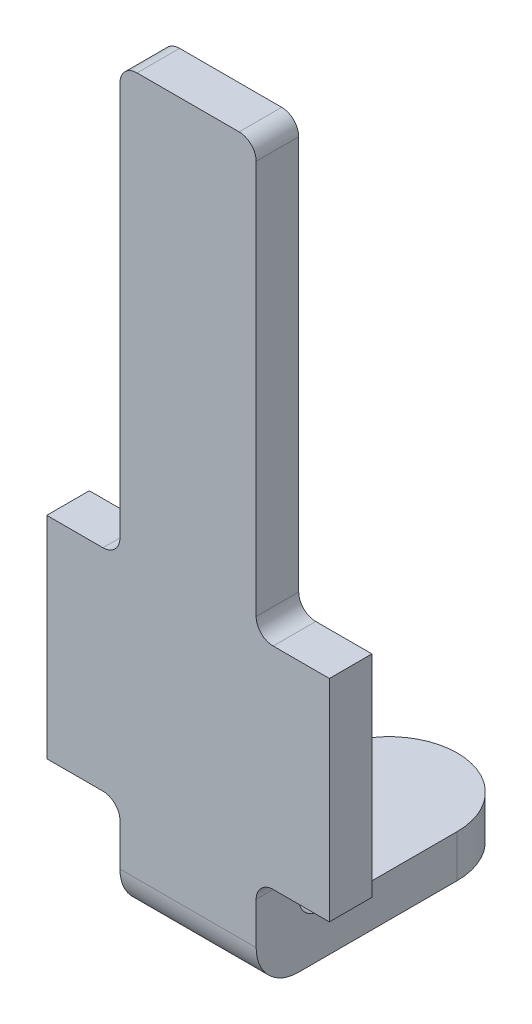
ISO-10303-21;
HEADER;
FILE_DESCRIPTION(('STEP AP214'),'2;1');
FILE_NAME('part.step','',(''),(''),'','','');
FILE_SCHEMA(('AUTOMOTIVE_DESIGN { 1 0 10303 214 1 1 1 1 }'));
ENDSEC;
DATA;
#1=APPLICATION_CONTEXT('core data for automotive mechanical design processes');
#2=APPLICATION_PROTOCOL_DEFINITION('international standard','automotive_design',2000,#1);
#3=PRODUCT_CONTEXT('',#1,'mechanical');
#4=PRODUCT('Part','Part','',(#3));
#5=PRODUCT_RELATED_PRODUCT_CATEGORY('part','',(#4));
#6=PRODUCT_DEFINITION_FORMATION('','',#4);
#7=PRODUCT_DEFINITION_CONTEXT('part definition',#1,'design');
#8=PRODUCT_DEFINITION('design','',#6,#7);
#9=PRODUCT_DEFINITION_SHAPE('','',#8);
#10=(LENGTH_UNIT() NAMED_UNIT(*) SI_UNIT(.MILLI.,.METRE.));
#11=(NAMED_UNIT(*) PLANE_ANGLE_UNIT() SI_UNIT($,.RADIAN.));
#12=(NAMED_UNIT(*) SI_UNIT($,.STERADIAN.) SOLID_ANGLE_UNIT());
#13=UNCERTAINTY_MEASURE_WITH_UNIT(LENGTH_MEASURE(1.E-05),#10,'distance_accuracy_value','');
#14=(GEOMETRIC_REPRESENTATION_CONTEXT(3) GLOBAL_UNCERTAINTY_ASSIGNED_CONTEXT((#13)) GLOBAL_UNIT_ASSIGNED_CONTEXT((#10,
#11,#12)) REPRESENTATION_CONTEXT('',''));
#15=CARTESIAN_POINT('',(0.,0.,0.));
#16=DIRECTION('',(0.,0.,1.));
#17=DIRECTION('',(1.,0.,0.));
#18=AXIS2_PLACEMENT_3D('',#15,#16,#17);
#19=CARTESIAN_POINT('',(10.93,1.48437551370885,-0.748999999999983));
#20=DIRECTION('',(0.,0.,-1.));
#21=DIRECTION('',(1.,0.,0.));
#22=AXIS2_PLACEMENT_3D('',#19,#20,#21);
#23=CYLINDRICAL_SURFACE('',#22,0.1);
#24=CARTESIAN_POINT('',(10.93,1.48437551370885,-0.498999999999983));
#25=DIRECTION('',(0.,0.,1.));
#26=DIRECTION('',(1.,0.,0.));
#27=AXIS2_PLACEMENT_3D('',#24,#25,#26);
#28=CIRCLE('',#27,0.1);
#29=CARTESIAN_POINT('',(10.93,1.38437551370885,-0.499000000000012));
#30=VERTEX_POINT('',#29);
#31=CARTESIAN_POINT('',(11.03,1.48437551370885,-0.498999999999983));
#32=VERTEX_POINT('',#31);
#33=EDGE_CURVE('E202',#30,#32,#28,.T.);
#34=ORIENTED_EDGE('',*,*,#33,.T.);
#35=DIRECTION('',(0.,0.,-1.));
#36=VECTOR('',#35,1.);
#37=CARTESIAN_POINT('',(11.03,1.48437551370885,-0.748999999999983));
#38=LINE('',#37,#36);
#39=CARTESIAN_POINT('',(11.03,1.48437551370885,-0.748999999999983));
#40=VERTEX_POINT('',#39);
#41=EDGE_CURVE('E200',#32,#40,#38,.T.);
#42=ORIENTED_EDGE('',*,*,#41,.T.);
#43=CARTESIAN_POINT('',(10.93,1.48437551370885,-0.748999999999983));
#44=DIRECTION('',(0.,0.,-1.));
#45=DIRECTION('',(-1.,0.,0.));
#46=AXIS2_PLACEMENT_3D('',#43,#44,#45);
#47=CIRCLE('',#46,0.1);
#48=CARTESIAN_POINT('',(10.93,1.38437551370885,-0.749000000000012));
#49=VERTEX_POINT('',#48);
#50=EDGE_CURVE('E184',#40,#49,#47,.T.);
#51=ORIENTED_EDGE('',*,*,#50,.T.);
#52=DIRECTION('',(0.,0.,1.));
#53=VECTOR('',#52,1.);
#54=CARTESIAN_POINT('',(10.93,1.38437551370885,-0.749000000000012));
#55=LINE('',#54,#53);
#56=EDGE_CURVE('E240',#49,#30,#55,.T.);
#57=ORIENTED_EDGE('',*,*,#56,.T.);
#58=EDGE_LOOP('',(#34,#42,#51,#57));
#59=FACE_BOUND('',#58,.T.);
#60=ADVANCED_FACE('F16',(#59),#23,.F.);
#61=CARTESIAN_POINT('',(11.93,1.48437551370885,-0.749000000000014));
#62=DIRECTION('',(0.,0.,1.));
#63=DIRECTION('',(-1.,0.,0.));
#64=AXIS2_PLACEMENT_3D('',#61,#62,#63);
#65=CYLINDRICAL_SURFACE('',#64,0.1);
#66=CARTESIAN_POINT('',(11.93,1.48437551370885,-0.498999999999985));
#67=DIRECTION('',(0.,0.,1.));
#68=DIRECTION('',(1.,0.,0.));
#69=AXIS2_PLACEMENT_3D('',#66,#67,#68);
#70=CIRCLE('',#69,0.1);
#71=CARTESIAN_POINT('',(11.83,1.48437551370885,-0.498999999999984));
#72=VERTEX_POINT('',#71);
#73=CARTESIAN_POINT('',(11.93,1.38437551370885,-0.499000000000013));
#74=VERTEX_POINT('',#73);
#75=EDGE_CURVE('E285',#72,#74,#70,.T.);
#76=ORIENTED_EDGE('',*,*,#75,.T.);
#77=DIRECTION('',(0.,0.,-1.));
#78=VECTOR('',#77,1.);
#79=CARTESIAN_POINT('',(11.93,1.38437551370885,-0.748999999999984));
#80=LINE('',#79,#78);
#81=CARTESIAN_POINT('',(11.93,1.38437551370885,-0.749000000000014));
#82=VERTEX_POINT('',#81);
#83=EDGE_CURVE('E42',#74,#82,#80,.T.);
#84=ORIENTED_EDGE('',*,*,#83,.T.);
#85=CARTESIAN_POINT('',(11.93,1.48437551370885,-0.748999999999984));
#86=DIRECTION('',(0.,0.,-1.));
#87=DIRECTION('',(-1.,0.,0.));
#88=AXIS2_PLACEMENT_3D('',#85,#86,#87);
#89=CIRCLE('',#88,0.1);
#90=CARTESIAN_POINT('',(11.83,1.48437551370885,-0.748999999999984));
#91=VERTEX_POINT('',#90);
#92=EDGE_CURVE('E311',#82,#91,#89,.T.);
#93=ORIENTED_EDGE('',*,*,#92,.T.);
#94=DIRECTION('',(0.,0.,1.));
#95=VECTOR('',#94,1.);
#96=CARTESIAN_POINT('',(11.83,1.48437551370885,-0.498999999999984));
#97=LINE('',#96,#95);
#98=EDGE_CURVE('E227',#91,#72,#97,.T.);
#99=ORIENTED_EDGE('',*,*,#98,.T.);
#100=EDGE_LOOP('',(#76,#84,#93,#99));
#101=FACE_BOUND('',#100,.T.);
#102=ADVANCED_FACE('F731',(#101),#65,.F.);
#103=CARTESIAN_POINT('',(10.93,0.0459658151929143,-0.749000000000012));
#104=DIRECTION('',(0.,0.,1.));
#105=DIRECTION('',(-1.,0.,0.));
#106=AXIS2_PLACEMENT_3D('',#103,#104,#105);
#107=CYLINDRICAL_SURFACE('',#106,0.1);
#108=CARTESIAN_POINT('',(10.93,0.0459658151929143,-0.498999999999983));
#109=DIRECTION('',(0.,0.,1.));
#110=DIRECTION('',(1.,0.,0.));
#111=AXIS2_PLACEMENT_3D('',#108,#109,#110);
#112=CIRCLE('',#111,0.1);
#113=CARTESIAN_POINT('',(11.03,0.0459658151929143,-0.498999999999983));
#114=VERTEX_POINT('',#113);
#115=CARTESIAN_POINT('',(10.93,0.145965815192914,-0.499000000000012));
#116=VERTEX_POINT('',#115);
#117=EDGE_CURVE('E318',#114,#116,#112,.T.);
#118=ORIENTED_EDGE('',*,*,#117,.T.);
#119=DIRECTION('',(0.,0.,-1.));
#120=VECTOR('',#119,1.);
#121=CARTESIAN_POINT('',(10.93,0.145965815192914,-0.748999999999983));
#122=LINE('',#121,#120);
#123=CARTESIAN_POINT('',(10.93,0.145965815192914,-0.749000000000012));
#124=VERTEX_POINT('',#123);
#125=EDGE_CURVE('E253',#116,#124,#122,.T.);
#126=ORIENTED_EDGE('',*,*,#125,.T.);
#127=CARTESIAN_POINT('',(10.93,0.0459658151929143,-0.748999999999983));
#128=DIRECTION('',(0.,0.,-1.));
#129=DIRECTION('',(-1.,0.,0.));
#130=AXIS2_PLACEMENT_3D('',#127,#128,#129);
#131=CIRCLE('',#130,0.1);
#132=CARTESIAN_POINT('',(11.03,0.0459658151929143,-0.748999999999983));
#133=VERTEX_POINT('',#132);
#134=EDGE_CURVE('E328',#124,#133,#131,.T.);
#135=ORIENTED_EDGE('',*,*,#134,.T.);
#136=DIRECTION('',(0.,0.,1.));
#137=VECTOR('',#136,1.);
#138=CARTESIAN_POINT('',(11.03,0.0459658151929143,-0.499000000000012));
#139=LINE('',#138,#137);
#140=EDGE_CURVE('E268',#133,#114,#139,.T.);
#141=ORIENTED_EDGE('',*,*,#140,.T.);
#142=EDGE_LOOP('',(#118,#126,#135,#141));
#143=FACE_BOUND('',#142,.T.);
#144=ADVANCED_FACE('F18',(#143),#107,.F.);
#145=CARTESIAN_POINT('',(11.93,0.0459658151929143,-0.748999999999984));
#146=DIRECTION('',(0.,0.,-1.));
#147=DIRECTION('',(1.,0.,0.));
#148=AXIS2_PLACEMENT_3D('',#145,#146,#147);
#149=CYLINDRICAL_SURFACE('',#148,0.1);
#150=CARTESIAN_POINT('',(11.93,0.0459658151929143,-0.498999999999984));
#151=DIRECTION('',(0.,0.,1.));
#152=DIRECTION('',(1.,0.,0.));
#153=AXIS2_PLACEMENT_3D('',#150,#151,#152);
#154=CIRCLE('',#153,0.1);
#155=CARTESIAN_POINT('',(11.93,0.145965815192914,-0.499000000000013));
#156=VERTEX_POINT('',#155);
#157=CARTESIAN_POINT('',(11.83,0.0459658151929143,-0.498999999999984));
#158=VERTEX_POINT('',#157);
#159=EDGE_CURVE('E261',#156,#158,#154,.T.);
#160=ORIENTED_EDGE('',*,*,#159,.T.);
#161=DIRECTION('',(0.,0.,-1.));
#162=VECTOR('',#161,1.);
#163=CARTESIAN_POINT('',(11.83,0.0459658151929143,-0.748999999999984));
#164=LINE('',#163,#162);
#165=CARTESIAN_POINT('',(11.83,0.0459658151929143,-0.748999999999984));
#166=VERTEX_POINT('',#165);
#167=EDGE_CURVE('E324',#158,#166,#164,.T.);
#168=ORIENTED_EDGE('',*,*,#167,.T.);
#169=CARTESIAN_POINT('',(11.93,0.0459658151929143,-0.748999999999984));
#170=DIRECTION('',(0.,0.,-1.));
#171=DIRECTION('',(-1.,0.,0.));
#172=AXIS2_PLACEMENT_3D('',#169,#170,#171);
#173=CIRCLE('',#172,0.1);
#174=CARTESIAN_POINT('',(11.93,0.145965815192914,-0.749000000000013));
#175=VERTEX_POINT('',#174);
#176=EDGE_CURVE('E235',#166,#175,#173,.T.);
#177=ORIENTED_EDGE('',*,*,#176,.T.);
#178=DIRECTION('',(0.,0.,1.));
#179=VECTOR('',#178,1.);
#180=CARTESIAN_POINT('',(11.93,0.145965815192914,-0.749000000000013));
#181=LINE('',#180,#179);
#182=EDGE_CURVE('E11',#175,#156,#181,.T.);
#183=ORIENTED_EDGE('',*,*,#182,.T.);
#184=EDGE_LOOP('',(#160,#168,#177,#183));
#185=FACE_BOUND('',#184,.T.);
#186=ADVANCED_FACE('F458',(#185),#149,.F.);
#187=CARTESIAN_POINT('',(11.13,3.8,-0.748999999999983));
#188=DIRECTION('',(0.,0.,1.));
#189=DIRECTION('',(-1.,0.,0.));
#190=AXIS2_PLACEMENT_3D('',#187,#188,#189);
#191=CYLINDRICAL_SURFACE('',#190,0.1);
#192=CARTESIAN_POINT('',(11.13,3.8,-0.498999999999984));
#193=DIRECTION('',(0.,0.,-1.));
#194=DIRECTION('',(1.,0.,0.));
#195=AXIS2_PLACEMENT_3D('',#192,#193,#194);
#196=CIRCLE('',#195,0.1);
#197=CARTESIAN_POINT('',(11.03,3.8,-0.498999999999984));
#198=VERTEX_POINT('',#197);
#199=CARTESIAN_POINT('',(11.13,3.9,-0.498999999999984));
#200=VERTEX_POINT('',#199);
#201=EDGE_CURVE('E384',#198,#200,#196,.T.);
#202=ORIENTED_EDGE('',*,*,#201,.T.);
#203=DIRECTION('',(0.,0.,-1.));
#204=VECTOR('',#203,1.);
#205=CARTESIAN_POINT('',(11.13,3.9,-0.748999999999983));
#206=LINE('',#205,#204);
#207=CARTESIAN_POINT('',(11.13,3.9,-0.748999999999983));
#208=VERTEX_POINT('',#207);
#209=EDGE_CURVE('E246',#200,#208,#206,.T.);
#210=ORIENTED_EDGE('',*,*,#209,.T.);
#211=CARTESIAN_POINT('',(11.13,3.8,-0.748999999999983));
#212=DIRECTION('',(0.,0.,1.));
#213=DIRECTION('',(-1.,0.,0.));
#214=AXIS2_PLACEMENT_3D('',#211,#212,#213);
#215=CIRCLE('',#214,0.1);
#216=CARTESIAN_POINT('',(11.03,3.8,-0.748999999999983));
#217=VERTEX_POINT('',#216);
#218=EDGE_CURVE('E197',#208,#217,#215,.T.);
#219=ORIENTED_EDGE('',*,*,#218,.T.);
#220=DIRECTION('',(0.,0.,1.));
#221=VECTOR('',#220,1.);
#222=CARTESIAN_POINT('',(11.03,3.8,-0.498999999999984));
#223=LINE('',#222,#221);
#224=EDGE_CURVE('E212',#217,#198,#223,.T.);
#225=ORIENTED_EDGE('',*,*,#224,.T.);
#226=EDGE_LOOP('',(#202,#210,#219,#225));
#227=FACE_BOUND('',#226,.T.);
#228=ADVANCED_FACE('F709',(#227),#191,.T.);
#229=CARTESIAN_POINT('',(11.73,3.8,-0.748999999999984));
#230=DIRECTION('',(0.,0.,-1.));
#231=DIRECTION('',(1.,0.,0.));
#232=AXIS2_PLACEMENT_3D('',#229,#230,#231);
#233=CYLINDRICAL_SURFACE('',#232,0.1);
#234=CARTESIAN_POINT('',(11.73,3.8,-0.498999999999985));
#235=DIRECTION('',(0.,0.,-1.));
#236=DIRECTION('',(1.,0.,0.));
#237=AXIS2_PLACEMENT_3D('',#234,#235,#236);
#238=CIRCLE('',#237,0.1);
#239=CARTESIAN_POINT('',(11.73,3.9,-0.498999999999985));
#240=VERTEX_POINT('',#239);
#241=CARTESIAN_POINT('',(11.83,3.8,-0.498999999999985));
#242=VERTEX_POINT('',#241);
#243=EDGE_CURVE('E288',#240,#242,#238,.T.);
#244=ORIENTED_EDGE('',*,*,#243,.T.);
#245=DIRECTION('',(0.,0.,-1.));
#246=VECTOR('',#245,1.);
#247=CARTESIAN_POINT('',(11.83,3.8,-0.748999999999984));
#248=LINE('',#247,#246);
#249=CARTESIAN_POINT('',(11.83,3.8,-0.748999999999984));
#250=VERTEX_POINT('',#249);
#251=EDGE_CURVE('E214',#242,#250,#248,.T.);
#252=ORIENTED_EDGE('',*,*,#251,.T.);
#253=CARTESIAN_POINT('',(11.73,3.8,-0.748999999999984));
#254=DIRECTION('',(0.,0.,1.));
#255=DIRECTION('',(-1.,0.,0.));
#256=AXIS2_PLACEMENT_3D('',#253,#254,#255);
#257=CIRCLE('',#256,0.1);
#258=CARTESIAN_POINT('',(11.73,3.9,-0.748999999999984));
#259=VERTEX_POINT('',#258);
#260=EDGE_CURVE('E365',#250,#259,#257,.T.);
#261=ORIENTED_EDGE('',*,*,#260,.T.);
#262=DIRECTION('',(0.,0.,1.));
#263=VECTOR('',#262,1.);
#264=CARTESIAN_POINT('',(11.73,3.9,-0.748999999999984));
#265=LINE('',#264,#263);
#266=EDGE_CURVE('E245',#259,#240,#265,.T.);
#267=ORIENTED_EDGE('',*,*,#266,.T.);
#268=EDGE_LOOP('',(#244,#252,#261,#267));
#269=FACE_BOUND('',#268,.T.);
#270=ADVANCED_FACE('F678',(#269),#233,.T.);
#271=CARTESIAN_POINT('',(12.26,0.,-1.00308650274883E-13));
#272=DIRECTION('',(-1.,0.,0.));
#273=DIRECTION('',(0.,1.,0.));
#274=AXIS2_PLACEMENT_3D('',#271,#272,#273);
#275=PLANE('',#274);
#276=DIRECTION('',(0.,0.,1.));
#277=VECTOR('',#276,1.);
#278=CARTESIAN_POINT('',(12.26,1.38437551370885,-0.749000000000014));
#279=LINE('',#278,#277);
#280=CARTESIAN_POINT('',(12.26,1.38437551370885,-0.749000000000014));
#281=VERTEX_POINT('',#280);
#282=CARTESIAN_POINT('',(12.26,1.38437551370885,-0.499000000000014));
#283=VERTEX_POINT('',#282);
#284=EDGE_CURVE('E237',#281,#283,#279,.T.);
#285=ORIENTED_EDGE('',*,*,#284,.T.);
#286=DIRECTION('',(0.,-1.,0.));
#287=VECTOR('',#286,1.);
#288=CARTESIAN_POINT('',(12.26,1.38437551370885,-0.499000000000014));
#289=LINE('',#288,#287);
#290=CARTESIAN_POINT('',(12.26,0.145965815192914,-0.499000000000014));
#291=VERTEX_POINT('',#290);
#292=EDGE_CURVE('E260',#283,#291,#289,.T.);
#293=ORIENTED_EDGE('',*,*,#292,.T.);
#294=DIRECTION('',(0.,0.,1.));
#295=VECTOR('',#294,1.);
#296=CARTESIAN_POINT('',(12.26,0.145965815192914,-0.749000000000014));
#297=LINE('',#296,#295);
#298=CARTESIAN_POINT('',(12.26,0.145965815192914,-0.749000000000014));
#299=VERTEX_POINT('',#298);
#300=EDGE_CURVE('E27',#299,#291,#297,.T.);
#301=ORIENTED_EDGE('',*,*,#300,.F.);
#302=DIRECTION('',(0.,-1.,0.));
#303=VECTOR('',#302,1.);
#304=CARTESIAN_POINT('',(12.26,1.38437551370885,-0.749000000000014));
#305=LINE('',#304,#303);
#306=EDGE_CURVE('E236',#281,#299,#305,.T.);
#307=ORIENTED_EDGE('',*,*,#306,.F.);
#308=EDGE_LOOP('',(#285,#293,#301,#307));
#309=FACE_BOUND('',#308,.T.);
#310=ADVANCED_FACE('F464',(#309),#275,.F.);
#311=CARTESIAN_POINT('',(10.6,0.145965815192914,-0.749000000000011));
#312=DIRECTION('',(0.,-1.,0.));
#313=DIRECTION('',(0.,0.,-1.));
#314=AXIS2_PLACEMENT_3D('',#311,#312,#313);
#315=PLANE('',#314);
#316=DIRECTION('',(1.,0.,0.));
#317=VECTOR('',#316,1.);
#318=CARTESIAN_POINT('',(10.6,0.145965815192914,-0.749000000000011));
#319=LINE('',#318,#317);
#320=EDGE_CURVE('E231',#175,#299,#319,.T.);
#321=ORIENTED_EDGE('',*,*,#320,.T.);
#322=ORIENTED_EDGE('',*,*,#300,.T.);
#323=DIRECTION('',(1.,0.,0.));
#324=VECTOR('',#323,1.);
#325=CARTESIAN_POINT('',(10.6,0.145965815192914,-0.499000000000011));
#326=LINE('',#325,#324);
#327=EDGE_CURVE('E256',#156,#291,#326,.T.);
#328=ORIENTED_EDGE('',*,*,#327,.F.);
#329=ORIENTED_EDGE('',*,*,#182,.F.);
#330=EDGE_LOOP('',(#321,#322,#328,#329));
#331=FACE_BOUND('',#330,.T.);
#332=ADVANCED_FACE('F453',(#331),#315,.T.);
#333=CARTESIAN_POINT('',(10.6,1.38437551370885,-0.749000000000012));
#334=DIRECTION('',(0.,-1.,0.));
#335=DIRECTION('',(0.,0.,-1.));
#336=AXIS2_PLACEMENT_3D('',#333,#334,#335);
#337=PLANE('',#336);
#338=DIRECTION('',(1.,0.,0.));
#339=VECTOR('',#338,1.);
#340=CARTESIAN_POINT('',(10.6,1.38437551370885,-0.499000000000011));
#341=LINE('',#340,#339);
#342=EDGE_CURVE('E289',#74,#283,#341,.T.);
#343=ORIENTED_EDGE('',*,*,#342,.T.);
#344=ORIENTED_EDGE('',*,*,#284,.F.);
#345=DIRECTION('',(1.,0.,0.));
#346=VECTOR('',#345,1.);
#347=CARTESIAN_POINT('',(10.6,1.38437551370885,-0.749000000000012));
#348=LINE('',#347,#346);
#349=EDGE_CURVE('E314',#82,#281,#348,.T.);
#350=ORIENTED_EDGE('',*,*,#349,.F.);
#351=ORIENTED_EDGE('',*,*,#83,.F.);
#352=EDGE_LOOP('',(#343,#344,#350,#351));
#353=FACE_BOUND('',#352,.T.);
#354=ADVANCED_FACE('F756',(#353),#337,.F.);
#355=CARTESIAN_POINT('',(10.6,1.38437551370885,-0.749000000000012));
#356=DIRECTION('',(0.,-1.,0.));
#357=DIRECTION('',(0.,0.,-1.));
#358=AXIS2_PLACEMENT_3D('',#355,#356,#357);
#359=PLANE('',#358);
#360=DIRECTION('',(1.,0.,0.));
#361=VECTOR('',#360,1.);
#362=CARTESIAN_POINT('',(10.6,1.38437551370885,-0.749000000000012));
#363=LINE('',#362,#361);
#364=CARTESIAN_POINT('',(10.6,1.38437551370885,-0.749000000000012));
#365=VERTEX_POINT('',#364);
#366=EDGE_CURVE('E193',#365,#49,#363,.T.);
#367=ORIENTED_EDGE('',*,*,#366,.F.);
#368=DIRECTION('',(0.,0.,1.));
#369=VECTOR('',#368,1.);
#370=CARTESIAN_POINT('',(10.6,1.38437551370885,-0.749000000000012));
#371=LINE('',#370,#369);
#372=CARTESIAN_POINT('',(10.6,1.38437551370885,-0.499000000000011));
#373=VERTEX_POINT('',#372);
#374=EDGE_CURVE('E265',#365,#373,#371,.T.);
#375=ORIENTED_EDGE('',*,*,#374,.T.);
#376=DIRECTION('',(1.,0.,0.));
#377=VECTOR('',#376,1.);
#378=CARTESIAN_POINT('',(10.6,1.38437551370885,-0.499000000000011));
#379=LINE('',#378,#377);
#380=EDGE_CURVE('E274',#373,#30,#379,.T.);
#381=ORIENTED_EDGE('',*,*,#380,.T.);
#382=ORIENTED_EDGE('',*,*,#56,.F.);
#383=EDGE_LOOP('',(#367,#375,#381,#382));
#384=FACE_BOUND('',#383,.T.);
#385=ADVANCED_FACE('F760',(#384),#359,.F.);
#386=CARTESIAN_POINT('',(10.6,0.145965815192914,-0.749000000000011));
#387=DIRECTION('',(0.,-1.,0.));
#388=DIRECTION('',(0.,0.,-1.));
#389=AXIS2_PLACEMENT_3D('',#386,#387,#388);
#390=PLANE('',#389);
#391=DIRECTION('',(1.,0.,0.));
#392=VECTOR('',#391,1.);
#393=CARTESIAN_POINT('',(10.6,0.145965815192914,-0.499000000000011));
#394=LINE('',#393,#392);
#395=CARTESIAN_POINT('',(10.6,0.145965815192914,-0.499000000000011));
#396=VERTEX_POINT('',#395);
#397=EDGE_CURVE('E310',#396,#116,#394,.T.);
#398=ORIENTED_EDGE('',*,*,#397,.F.);
#399=DIRECTION('',(0.,0.,1.));
#400=VECTOR('',#399,1.);
#401=CARTESIAN_POINT('',(10.6,0.145965815192914,-0.749000000000011));
#402=LINE('',#401,#400);
#403=CARTESIAN_POINT('',(10.6,0.145965815192914,-0.749000000000011));
#404=VERTEX_POINT('',#403);
#405=EDGE_CURVE('E20',#404,#396,#402,.T.);
#406=ORIENTED_EDGE('',*,*,#405,.F.);
#407=DIRECTION('',(1.,0.,0.));
#408=VECTOR('',#407,1.);
#409=CARTESIAN_POINT('',(10.6,0.145965815192914,-0.749000000000011));
#410=LINE('',#409,#408);
#411=EDGE_CURVE('E297',#404,#124,#410,.T.);
#412=ORIENTED_EDGE('',*,*,#411,.T.);
#413=ORIENTED_EDGE('',*,*,#125,.F.);
#414=EDGE_LOOP('',(#398,#406,#412,#413));
#415=FACE_BOUND('',#414,.T.);
#416=ADVANCED_FACE('F750',(#415),#390,.T.);
#417=CARTESIAN_POINT('',(10.6,0.,0.));
#418=DIRECTION('',(-1.,0.,0.));
#419=DIRECTION('',(0.,1.,0.));
#420=AXIS2_PLACEMENT_3D('',#417,#418,#419);
#421=PLANE('',#420);
#422=ORIENTED_EDGE('',*,*,#374,.F.);
#423=DIRECTION('',(0.,-1.,0.));
#424=VECTOR('',#423,1.);
#425=CARTESIAN_POINT('',(10.6,1.38437551370885,-0.749000000000012));
#426=LINE('',#425,#424);
#427=EDGE_CURVE('E264',#365,#404,#426,.T.);
#428=ORIENTED_EDGE('',*,*,#427,.T.);
#429=ORIENTED_EDGE('',*,*,#405,.T.);
#430=DIRECTION('',(0.,-1.,0.));
#431=VECTOR('',#430,1.);
#432=CARTESIAN_POINT('',(10.6,1.38437551370885,-0.499000000000011));
#433=LINE('',#432,#431);
#434=EDGE_CURVE('E278',#373,#396,#433,.T.);
#435=ORIENTED_EDGE('',*,*,#434,.F.);
#436=EDGE_LOOP('',(#422,#428,#429,#435));
#437=FACE_BOUND('',#436,.T.);
#438=ADVANCED_FACE('F669',(#437),#421,.T.);
#439=CARTESIAN_POINT('',(11.43,-0.2,-1.68));
#440=DIRECTION('',(0.,-1.,0.));
#441=DIRECTION('',(0.,0.,1.));
#442=AXIS2_PLACEMENT_3D('',#439,#440,#441);
#443=CYLINDRICAL_SURFACE('',#442,0.4);
#444=DIRECTION('',(0.,-1.,0.));
#445=VECTOR('',#444,1.);
#446=CARTESIAN_POINT('',(11.83,-0.2,-1.68));
#447=LINE('',#446,#445);
#448=CARTESIAN_POINT('',(11.83,-0.2,-1.68));
#449=VERTEX_POINT('',#448);
#450=CARTESIAN_POINT('',(11.83,-0.45,-1.68));
#451=VERTEX_POINT('',#450);
#452=EDGE_CURVE('E391',#449,#451,#447,.T.);
#453=ORIENTED_EDGE('',*,*,#452,.T.);
#454=CARTESIAN_POINT('',(11.43,-0.45,-1.68));
#455=DIRECTION('',(0.,1.,0.));
#456=DIRECTION('',(0.,0.,-1.));
#457=AXIS2_PLACEMENT_3D('',#454,#455,#456);
#458=CIRCLE('',#457,0.4);
#459=CARTESIAN_POINT('',(11.03,-0.45,-1.68));
#460=VERTEX_POINT('',#459);
#461=EDGE_CURVE('E252',#451,#460,#458,.T.);
#462=ORIENTED_EDGE('',*,*,#461,.T.);
#463=DIRECTION('',(0.,1.,0.));
#464=VECTOR('',#463,1.);
#465=CARTESIAN_POINT('',(11.03,-0.2,-1.68));
#466=LINE('',#465,#464);
#467=CARTESIAN_POINT('',(11.03,-0.2,-1.68));
#468=VERTEX_POINT('',#467);
#469=EDGE_CURVE('E321',#460,#468,#466,.T.);
#470=ORIENTED_EDGE('',*,*,#469,.T.);
#471=CARTESIAN_POINT('',(11.43,-0.2,-1.68));
#472=DIRECTION('',(0.,-1.,0.));
#473=DIRECTION('',(0.,0.,1.));
#474=AXIS2_PLACEMENT_3D('',#471,#472,#473);
#475=CIRCLE('',#474,0.4);
#476=EDGE_CURVE('E306',#468,#449,#475,.T.);
#477=ORIENTED_EDGE('',*,*,#476,.T.);
#478=EDGE_LOOP('',(#453,#462,#470,#477));
#479=FACE_BOUND('',#478,.T.);
#480=ADVANCED_FACE('F664',(#479),#443,.T.);
#481=CARTESIAN_POINT('',(11.03,-0.2,-0.748999999999983));
#482=DIRECTION('',(-1.,0.,0.));
#483=DIRECTION('',(0.,1.,0.));
#484=AXIS2_PLACEMENT_3D('',#481,#482,#483);
#485=PLANE('',#484);
#486=DIRECTION('',(0.,-1.,0.));
#487=VECTOR('',#486,1.);
#488=CARTESIAN_POINT('',(11.03,3.9,-0.748999999999983));
#489=LINE('',#488,#487);
#490=CARTESIAN_POINT('',(11.03,-0.0749999999999988,-0.748999999999983));
#491=VERTEX_POINT('',#490);
#492=EDGE_CURVE('E325',#133,#491,#489,.T.);
#493=ORIENTED_EDGE('',*,*,#492,.T.);
#494=CARTESIAN_POINT('',(11.03,-0.0749999999999988,-0.873999999999983));
#495=DIRECTION('',(1.,0.,0.));
#496=DIRECTION('',(0.,0.,-1.));
#497=AXIS2_PLACEMENT_3D('',#494,#495,#496);
#498=CIRCLE('',#497,0.125);
#499=CARTESIAN_POINT('',(11.03,-0.2,-0.873999999999983));
#500=VERTEX_POINT('',#499);
#501=EDGE_CURVE('E284',#491,#500,#498,.T.);
#502=ORIENTED_EDGE('',*,*,#501,.T.);
#503=DIRECTION('',(0.,0.,-1.));
#504=VECTOR('',#503,1.);
#505=CARTESIAN_POINT('',(11.03,-0.2,-0.873999999999983));
#506=LINE('',#505,#504);
#507=EDGE_CURVE('E332',#500,#468,#506,.T.);
#508=ORIENTED_EDGE('',*,*,#507,.T.);
#509=ORIENTED_EDGE('',*,*,#469,.F.);
#510=DIRECTION('',(0.,0.,1.));
#511=VECTOR('',#510,1.);
#512=CARTESIAN_POINT('',(11.03,-0.45,-0.748999999999983));
#513=LINE('',#512,#511);
#514=CARTESIAN_POINT('',(11.03,-0.45,-0.748999999999983));
#515=VERTEX_POINT('',#514);
#516=EDGE_CURVE('E269',#460,#515,#513,.T.);
#517=ORIENTED_EDGE('',*,*,#516,.T.);
#518=CARTESIAN_POINT('',(11.03,-0.2,-0.748999999999983));
#519=DIRECTION('',(-1.,0.,0.));
#520=DIRECTION('',(0.,0.,-1.));
#521=AXIS2_PLACEMENT_3D('',#518,#519,#520);
#522=CIRCLE('',#521,0.25);
#523=CARTESIAN_POINT('',(11.03,-0.2,-0.498999999999983));
#524=VERTEX_POINT('',#523);
#525=EDGE_CURVE('E273',#515,#524,#522,.T.);
#526=ORIENTED_EDGE('',*,*,#525,.T.);
#527=DIRECTION('',(0.,1.,0.));
#528=VECTOR('',#527,1.);
#529=CARTESIAN_POINT('',(11.03,3.9,-0.498999999999984));
#530=LINE('',#529,#528);
#531=EDGE_CURVE('E302',#524,#114,#530,.T.);
#532=ORIENTED_EDGE('',*,*,#531,.T.);
#533=ORIENTED_EDGE('',*,*,#140,.F.);
#534=EDGE_LOOP('',(#493,#502,#508,#509,#517,#526,#532,#533));
#535=FACE_BOUND('',#534,.T.);
#536=ADVANCED_FACE('F668',(#535),#485,.T.);
#537=CARTESIAN_POINT('',(11.83,-0.2,-0.748999999999984));
#538=DIRECTION('',(-1.,0.,0.));
#539=DIRECTION('',(0.,1.,0.));
#540=AXIS2_PLACEMENT_3D('',#537,#538,#539);
#541=PLANE('',#540);
#542=DIRECTION('',(0.,1.,0.));
#543=VECTOR('',#542,1.);
#544=CARTESIAN_POINT('',(11.83,3.9,-0.498999999999985));
#545=LINE('',#544,#543);
#546=CARTESIAN_POINT('',(11.83,-0.2,-0.498999999999984));
#547=VERTEX_POINT('',#546);
#548=EDGE_CURVE('E298',#547,#158,#545,.T.);
#549=ORIENTED_EDGE('',*,*,#548,.F.);
#550=CARTESIAN_POINT('',(11.83,-0.2,-0.748999999999984));
#551=DIRECTION('',(-1.,0.,0.));
#552=DIRECTION('',(0.,0.,-1.));
#553=AXIS2_PLACEMENT_3D('',#550,#551,#552);
#554=CIRCLE('',#553,0.25);
#555=CARTESIAN_POINT('',(11.83,-0.45,-0.748999999999984));
#556=VERTEX_POINT('',#555);
#557=EDGE_CURVE('E385',#556,#547,#554,.T.);
#558=ORIENTED_EDGE('',*,*,#557,.F.);
#559=DIRECTION('',(0.,0.,1.));
#560=VECTOR('',#559,1.);
#561=CARTESIAN_POINT('',(11.83,-0.45,-0.748999999999984));
#562=LINE('',#561,#560);
#563=EDGE_CURVE('E247',#451,#556,#562,.T.);
#564=ORIENTED_EDGE('',*,*,#563,.F.);
#565=ORIENTED_EDGE('',*,*,#452,.F.);
#566=DIRECTION('',(0.,0.,-1.));
#567=VECTOR('',#566,1.);
#568=CARTESIAN_POINT('',(11.83,-0.2,-0.873999999999984));
#569=LINE('',#568,#567);
#570=CARTESIAN_POINT('',(11.83,-0.2,-0.873999999999984));
#571=VERTEX_POINT('',#570);
#572=EDGE_CURVE('E329',#571,#449,#569,.T.);
#573=ORIENTED_EDGE('',*,*,#572,.F.);
#574=CARTESIAN_POINT('',(11.83,-0.0749999999999988,-0.873999999999984));
#575=DIRECTION('',(1.,0.,0.));
#576=DIRECTION('',(0.,0.,-1.));
#577=AXIS2_PLACEMENT_3D('',#574,#575,#576);
#578=CIRCLE('',#577,0.125);
#579=CARTESIAN_POINT('',(11.83,-0.0749999999999988,-0.748999999999984));
#580=VERTEX_POINT('',#579);
#581=EDGE_CURVE('E279',#580,#571,#578,.T.);
#582=ORIENTED_EDGE('',*,*,#581,.F.);
#583=DIRECTION('',(0.,-1.,0.));
#584=VECTOR('',#583,1.);
#585=CARTESIAN_POINT('',(11.83,3.9,-0.748999999999984));
#586=LINE('',#585,#584);
#587=EDGE_CURVE('E290',#166,#580,#586,.T.);
#588=ORIENTED_EDGE('',*,*,#587,.F.);
#589=ORIENTED_EDGE('',*,*,#167,.F.);
#590=EDGE_LOOP('',(#549,#558,#564,#565,#573,#582,#588,#589));
#591=FACE_BOUND('',#590,.T.);
#592=ADVANCED_FACE('F429',(#591),#541,.F.);
#593=CARTESIAN_POINT('',(11.83,3.9,-0.498999999999985));
#594=DIRECTION('',(0.,0.,-1.));
#595=DIRECTION('',(-1.,0.,0.));
#596=AXIS2_PLACEMENT_3D('',#593,#594,#595);
#597=PLANE('',#596);
#598=DIRECTION('',(-1.,0.,0.));
#599=VECTOR('',#598,1.);
#600=CARTESIAN_POINT('',(11.83,3.9,-0.498999999999985));
#601=LINE('',#600,#599);
#602=EDGE_CURVE('E241',#240,#200,#601,.T.);
#603=ORIENTED_EDGE('',*,*,#602,.T.);
#604=ORIENTED_EDGE('',*,*,#201,.F.);
#605=DIRECTION('',(0.,1.,0.));
#606=VECTOR('',#605,1.);
#607=CARTESIAN_POINT('',(11.03,3.9,-0.498999999999984));
#608=LINE('',#607,#606);
#609=EDGE_CURVE('E207',#32,#198,#608,.T.);
#610=ORIENTED_EDGE('',*,*,#609,.F.);
#611=ORIENTED_EDGE('',*,*,#33,.F.);
#612=ORIENTED_EDGE('',*,*,#380,.F.);
#613=ORIENTED_EDGE('',*,*,#434,.T.);
#614=ORIENTED_EDGE('',*,*,#397,.T.);
#615=ORIENTED_EDGE('',*,*,#117,.F.);
#616=ORIENTED_EDGE('',*,*,#531,.F.);
#617=DIRECTION('',(-1.,0.,0.));
#618=VECTOR('',#617,1.);
#619=CARTESIAN_POINT('',(11.83,-0.2,-0.498999999999984));
#620=LINE('',#619,#618);
#621=EDGE_CURVE('E380',#547,#524,#620,.T.);
#622=ORIENTED_EDGE('',*,*,#621,.F.);
#623=ORIENTED_EDGE('',*,*,#548,.T.);
#624=ORIENTED_EDGE('',*,*,#159,.F.);
#625=ORIENTED_EDGE('',*,*,#327,.T.);
#626=ORIENTED_EDGE('',*,*,#292,.F.);
#627=ORIENTED_EDGE('',*,*,#342,.F.);
#628=ORIENTED_EDGE('',*,*,#75,.F.);
#629=DIRECTION('',(0.,1.,0.));
#630=VECTOR('',#629,1.);
#631=CARTESIAN_POINT('',(11.83,3.9,-0.498999999999985));
#632=LINE('',#631,#630);
#633=EDGE_CURVE('E230',#72,#242,#632,.T.);
#634=ORIENTED_EDGE('',*,*,#633,.T.);
#635=ORIENTED_EDGE('',*,*,#243,.F.);
#636=EDGE_LOOP('',(#603,#604,#610,#611,#612,#613,#614,#615,#616,#622,#623,#624,#625,#626,#627,
#628,#634,#635));
#637=FACE_BOUND('',#636,.T.);
#638=ADVANCED_FACE('F686',(#637),#597,.F.);
#639=CARTESIAN_POINT('',(11.83,-0.2,-0.748999999999984));
#640=DIRECTION('',(-1.,0.,0.));
#641=DIRECTION('',(0.,0.,-1.));
#642=AXIS2_PLACEMENT_3D('',#639,#640,#641);
#643=CYLINDRICAL_SURFACE('',#642,0.25);
#644=ORIENTED_EDGE('',*,*,#525,.F.);
#645=DIRECTION('',(-1.,0.,0.));
#646=VECTOR('',#645,1.);
#647=CARTESIAN_POINT('',(11.83,-0.45,-0.748999999999984));
#648=LINE('',#647,#646);
#649=EDGE_CURVE('E251',#556,#515,#648,.T.);
#650=ORIENTED_EDGE('',*,*,#649,.F.);
#651=ORIENTED_EDGE('',*,*,#557,.T.);
#652=ORIENTED_EDGE('',*,*,#621,.T.);
#653=EDGE_LOOP('',(#644,#650,#651,#652));
#654=FACE_BOUND('',#653,.T.);
#655=ADVANCED_FACE('F425',(#654),#643,.T.);
#656=CARTESIAN_POINT('',(11.83,-0.45,-0.748999999999984));
#657=DIRECTION('',(0.,1.,0.));
#658=DIRECTION('',(0.,0.,-1.));
#659=AXIS2_PLACEMENT_3D('',#656,#657,#658);
#660=PLANE('',#659);
#661=ORIENTED_EDGE('',*,*,#461,.F.);
#662=ORIENTED_EDGE('',*,*,#563,.T.);
#663=ORIENTED_EDGE('',*,*,#649,.T.);
#664=ORIENTED_EDGE('',*,*,#516,.F.);
#665=EDGE_LOOP('',(#661,#662,#663,#664));
#666=FACE_BOUND('',#665,.T.);
#667=ADVANCED_FACE('F659',(#666),#660,.F.);
#668=CARTESIAN_POINT('',(11.83,-0.2,-0.873999999999984));
#669=DIRECTION('',(0.,-1.,0.));
#670=DIRECTION('',(-1.,0.,0.));
#671=AXIS2_PLACEMENT_3D('',#668,#669,#670);
#672=PLANE('',#671);
#673=ORIENTED_EDGE('',*,*,#507,.F.);
#674=DIRECTION('',(-1.,0.,0.));
#675=VECTOR('',#674,1.);
#676=CARTESIAN_POINT('',(11.83,-0.2,-0.873999999999984));
#677=LINE('',#676,#675);
#678=EDGE_CURVE('E283',#571,#500,#677,.T.);
#679=ORIENTED_EDGE('',*,*,#678,.F.);
#680=ORIENTED_EDGE('',*,*,#572,.T.);
#681=ORIENTED_EDGE('',*,*,#476,.F.);
#682=EDGE_LOOP('',(#673,#679,#680,#681));
#683=FACE_BOUND('',#682,.T.);
#684=ADVANCED_FACE('F654',(#683),#672,.F.);
#685=CARTESIAN_POINT('',(11.83,-0.0749999999999988,-0.873999999999984));
#686=DIRECTION('',(-1.,0.,0.));
#687=DIRECTION('',(0.,0.,-1.));
#688=AXIS2_PLACEMENT_3D('',#685,#686,#687);
#689=CYLINDRICAL_SURFACE('',#688,0.125);
#690=ORIENTED_EDGE('',*,*,#501,.F.);
#691=DIRECTION('',(-1.,0.,0.));
#692=VECTOR('',#691,1.);
#693=CARTESIAN_POINT('',(11.83,-0.0749999999999988,-0.748999999999984));
#694=LINE('',#693,#692);
#695=EDGE_CURVE('E226',#580,#491,#694,.T.);
#696=ORIENTED_EDGE('',*,*,#695,.F.);
#697=ORIENTED_EDGE('',*,*,#581,.T.);
#698=ORIENTED_EDGE('',*,*,#678,.T.);
#699=EDGE_LOOP('',(#690,#696,#697,#698));
#700=FACE_BOUND('',#699,.T.);
#701=ADVANCED_FACE('F658',(#700),#689,.F.);
#702=CARTESIAN_POINT('',(11.83,3.9,-0.748999999999984));
#703=DIRECTION('',(0.,0.,1.));
#704=DIRECTION('',(1.,0.,0.));
#705=AXIS2_PLACEMENT_3D('',#702,#703,#704);
#706=PLANE('',#705);
#707=DIRECTION('',(0.,-1.,0.));
#708=VECTOR('',#707,1.);
#709=CARTESIAN_POINT('',(11.83,3.9,-0.748999999999984));
#710=LINE('',#709,#708);
#711=EDGE_CURVE('E222',#250,#91,#710,.T.);
#712=ORIENTED_EDGE('',*,*,#711,.T.);
#713=ORIENTED_EDGE('',*,*,#92,.F.);
#714=ORIENTED_EDGE('',*,*,#349,.T.);
#715=ORIENTED_EDGE('',*,*,#306,.T.);
#716=ORIENTED_EDGE('',*,*,#320,.F.);
#717=ORIENTED_EDGE('',*,*,#176,.F.);
#718=ORIENTED_EDGE('',*,*,#587,.T.);
#719=ORIENTED_EDGE('',*,*,#695,.T.);
#720=ORIENTED_EDGE('',*,*,#492,.F.);
#721=ORIENTED_EDGE('',*,*,#134,.F.);
#722=ORIENTED_EDGE('',*,*,#411,.F.);
#723=ORIENTED_EDGE('',*,*,#427,.F.);
#724=ORIENTED_EDGE('',*,*,#366,.T.);
#725=ORIENTED_EDGE('',*,*,#50,.F.);
#726=DIRECTION('',(0.,-1.,0.));
#727=VECTOR('',#726,1.);
#728=CARTESIAN_POINT('',(11.03,3.9,-0.748999999999983));
#729=LINE('',#728,#727);
#730=EDGE_CURVE('E190',#217,#40,#729,.T.);
#731=ORIENTED_EDGE('',*,*,#730,.F.);
#732=ORIENTED_EDGE('',*,*,#218,.F.);
#733=DIRECTION('',(-1.,0.,0.));
#734=VECTOR('',#733,1.);
#735=CARTESIAN_POINT('',(11.83,3.9,-0.748999999999984));
#736=LINE('',#735,#734);
#737=EDGE_CURVE('E373',#259,#208,#736,.T.);
#738=ORIENTED_EDGE('',*,*,#737,.F.);
#739=ORIENTED_EDGE('',*,*,#260,.F.);
#740=EDGE_LOOP('',(#712,#713,#714,#715,#716,#717,#718,#719,#720,#721,#722,#723,#724,#725,#731,
#732,#738,#739));
#741=FACE_BOUND('',#740,.T.);
#742=ADVANCED_FACE('F187',(#741),#706,.F.);
#743=CARTESIAN_POINT('',(11.83,3.9,-0.748999999999984));
#744=DIRECTION('',(0.,-1.,0.));
#745=DIRECTION('',(0.,0.,-1.));
#746=AXIS2_PLACEMENT_3D('',#743,#744,#745);
#747=PLANE('',#746);
#748=ORIENTED_EDGE('',*,*,#737,.T.);
#749=ORIENTED_EDGE('',*,*,#209,.F.);
#750=ORIENTED_EDGE('',*,*,#602,.F.);
#751=ORIENTED_EDGE('',*,*,#266,.F.);
#752=EDGE_LOOP('',(#748,#749,#750,#751));
#753=FACE_BOUND('',#752,.T.);
#754=ADVANCED_FACE('F701',(#753),#747,.F.);
#755=CARTESIAN_POINT('',(11.03,-0.2,-0.748999999999983));
#756=DIRECTION('',(-1.,0.,0.));
#757=DIRECTION('',(0.,1.,0.));
#758=AXIS2_PLACEMENT_3D('',#755,#756,#757);
#759=PLANE('',#758);
#760=ORIENTED_EDGE('',*,*,#730,.T.);
#761=ORIENTED_EDGE('',*,*,#41,.F.);
#762=ORIENTED_EDGE('',*,*,#609,.T.);
#763=ORIENTED_EDGE('',*,*,#224,.F.);
#764=EDGE_LOOP('',(#760,#761,#762,#763));
#765=FACE_BOUND('',#764,.T.);
#766=ADVANCED_FACE('F210',(#765),#759,.T.);
#767=CARTESIAN_POINT('',(11.83,-0.2,-0.748999999999984));
#768=DIRECTION('',(-1.,0.,0.));
#769=DIRECTION('',(0.,1.,0.));
#770=AXIS2_PLACEMENT_3D('',#767,#768,#769);
#771=PLANE('',#770);
#772=ORIENTED_EDGE('',*,*,#633,.F.);
#773=ORIENTED_EDGE('',*,*,#98,.F.);
#774=ORIENTED_EDGE('',*,*,#711,.F.);
#775=ORIENTED_EDGE('',*,*,#251,.F.);
#776=EDGE_LOOP('',(#772,#773,#774,#775));
#777=FACE_BOUND('',#776,.T.);
#778=ADVANCED_FACE('F765',(#777),#771,.F.);
#779=CLOSED_SHELL('',(#60,#102,#144,#186,#228,#270,#310,#332,#354,#385,#416,#438,#480,#536,#592,
#638,#655,#667,#684,#701,#742,#754,#766,#778));
#780=MANIFOLD_SOLID_BREP('B1',#779);
#781=ADVANCED_BREP_SHAPE_REPRESENTATION('',(#18,#780),#14);
#782=SHAPE_DEFINITION_REPRESENTATION(#9,#781);
ENDSEC;
END-ISO-10303-21;
